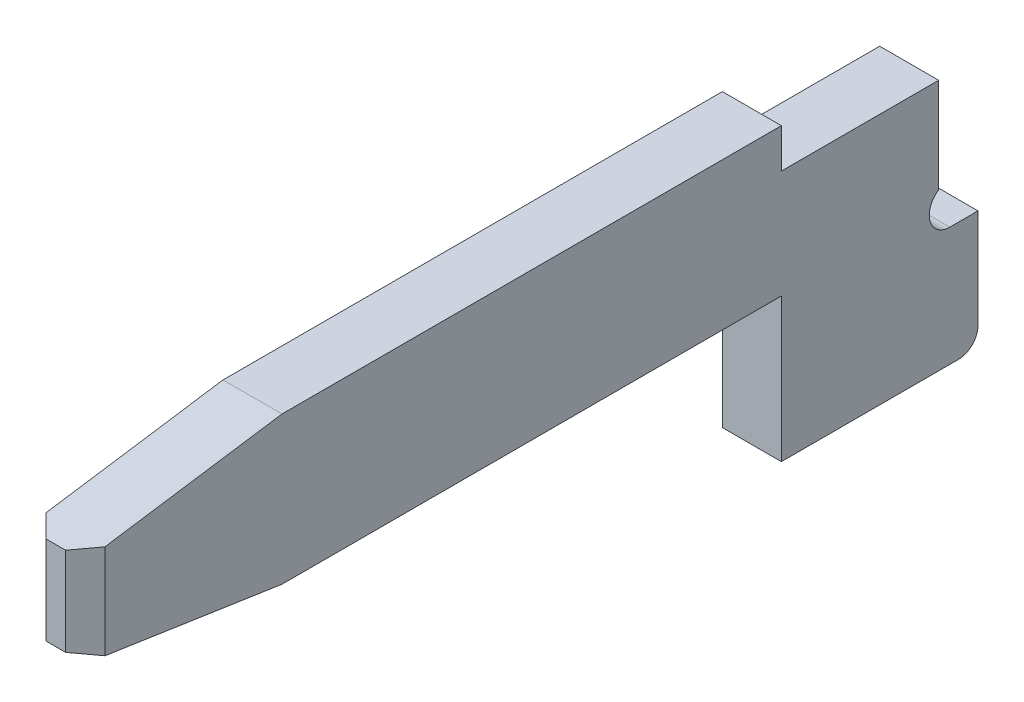
ISO-10303-21;
HEADER;
FILE_DESCRIPTION(('STEP AP214'),'2;1');
FILE_NAME('part.step','',(''),(''),'','','');
FILE_SCHEMA(('AUTOMOTIVE_DESIGN { 1 0 10303 214 1 1 1 1 }'));
ENDSEC;
DATA;
#1=APPLICATION_CONTEXT('core data for automotive mechanical design processes');
#2=APPLICATION_PROTOCOL_DEFINITION('international standard','automotive_design',2000,#1);
#3=PRODUCT_CONTEXT('',#1,'mechanical');
#4=PRODUCT('Part','Part','',(#3));
#5=PRODUCT_RELATED_PRODUCT_CATEGORY('part','',(#4));
#6=PRODUCT_DEFINITION_FORMATION('','',#4);
#7=PRODUCT_DEFINITION_CONTEXT('part definition',#1,'design');
#8=PRODUCT_DEFINITION('design','',#6,#7);
#9=PRODUCT_DEFINITION_SHAPE('','',#8);
#10=(LENGTH_UNIT() NAMED_UNIT(*) SI_UNIT(.MILLI.,.METRE.));
#11=(NAMED_UNIT(*) PLANE_ANGLE_UNIT() SI_UNIT($,.RADIAN.));
#12=(NAMED_UNIT(*) SI_UNIT($,.STERADIAN.) SOLID_ANGLE_UNIT());
#13=UNCERTAINTY_MEASURE_WITH_UNIT(LENGTH_MEASURE(1.E-05),#10,'distance_accuracy_value','');
#14=(GEOMETRIC_REPRESENTATION_CONTEXT(3) GLOBAL_UNCERTAINTY_ASSIGNED_CONTEXT((#13)) GLOBAL_UNIT_ASSIGNED_CONTEXT((#10,
#11,#12)) REPRESENTATION_CONTEXT('',''));
#15=CARTESIAN_POINT('',(0.,0.,0.));
#16=DIRECTION('',(0.,0.,1.));
#17=DIRECTION('',(1.,0.,0.));
#18=AXIS2_PLACEMENT_3D('',#15,#16,#17);
#19=CARTESIAN_POINT('',(-0.05,-0.55,3.94));
#20=DIRECTION('',(0.707106781186548,0.,-0.707106781186548));
#21=DIRECTION('',(-0.707106781186548,0.,-0.707106781186548));
#22=AXIS2_PLACEMENT_3D('',#19,#20,#21);
#23=PLANE('',#22);
#24=DIRECTION('',(0.,1.,0.));
#25=VECTOR('',#24,1.);
#26=CARTESIAN_POINT('',(-0.15,-1.18,3.84));
#27=LINE('',#26,#25);
#28=CARTESIAN_POINT('',(-0.15,0.0649999999999868,3.84));
#29=VERTEX_POINT('',#28);
#30=CARTESIAN_POINT('',(-0.15,-0.415000000000178,3.84000000000002));
#31=VERTEX_POINT('',#30);
#32=EDGE_CURVE('E261',#29,#31,#27,.F.);
#33=ORIENTED_EDGE('',*,*,#32,.T.);
#34=DIRECTION('',(0.703162553934632,0.105474383090055,0.703162553934649));
#35=VECTOR('',#34,1.);
#36=CARTESIAN_POINT('',(-0.15,-0.415000000000178,3.84000000000003));
#37=LINE('',#36,#35);
#38=CARTESIAN_POINT('',(-0.0499999999999999,-0.400000000000148,3.94000000000002));
#39=VERTEX_POINT('',#38);
#40=EDGE_CURVE('E258',#31,#39,#37,.T.);
#41=ORIENTED_EDGE('',*,*,#40,.T.);
#42=DIRECTION('',(0.,1.,0.));
#43=VECTOR('',#42,1.);
#44=CARTESIAN_POINT('',(-0.05,-0.55,3.94));
#45=LINE('',#44,#43);
#46=CARTESIAN_POINT('',(-0.05,0.05,3.94));
#47=VERTEX_POINT('',#46);
#48=EDGE_CURVE('E264',#39,#47,#45,.T.);
#49=ORIENTED_EDGE('',*,*,#48,.T.);
#50=DIRECTION('',(-0.70316255393463,0.105474383090055,-0.703162553934651));
#51=VECTOR('',#50,1.);
#52=CARTESIAN_POINT('',(-0.05,0.05,3.94));
#53=LINE('',#52,#51);
#54=EDGE_CURVE('E219',#47,#29,#53,.T.);
#55=ORIENTED_EDGE('',*,*,#54,.T.);
#56=EDGE_LOOP('',(#33,#41,#49,#55));
#57=FACE_BOUND('',#56,.T.);
#58=ADVANCED_FACE('F17',(#57),#23,.F.);
#59=CARTESIAN_POINT('',(0.15,-0.55,3.94));
#60=DIRECTION('',(0.,0.,-1.));
#61=DIRECTION('',(-1.,0.,0.));
#62=AXIS2_PLACEMENT_3D('',#59,#60,#61);
#63=PLANE('',#62);
#64=ORIENTED_EDGE('',*,*,#48,.F.);
#65=DIRECTION('',(1.,0.,0.));
#66=VECTOR('',#65,1.);
#67=CARTESIAN_POINT('',(0.15,-0.400000000000198,3.94000000000003));
#68=LINE('',#67,#66);
#69=CARTESIAN_POINT('',(0.05,-0.400000000000198,3.94000000000002));
#70=VERTEX_POINT('',#69);
#71=EDGE_CURVE('E253',#39,#70,#68,.T.);
#72=ORIENTED_EDGE('',*,*,#71,.T.);
#73=DIRECTION('',(0.,1.,0.));
#74=VECTOR('',#73,1.);
#75=CARTESIAN_POINT('',(0.0500000000000001,-1.18,3.94));
#76=LINE('',#75,#74);
#77=CARTESIAN_POINT('',(0.0500000000000001,0.0500000000000004,3.94));
#78=VERTEX_POINT('',#77);
#79=EDGE_CURVE('E192',#78,#70,#76,.F.);
#80=ORIENTED_EDGE('',*,*,#79,.F.);
#81=DIRECTION('',(1.,0.,0.));
#82=VECTOR('',#81,1.);
#83=CARTESIAN_POINT('',(0.15,0.05,3.94));
#84=LINE('',#83,#82);
#85=EDGE_CURVE('E263',#78,#47,#84,.F.);
#86=ORIENTED_EDGE('',*,*,#85,.T.);
#87=EDGE_LOOP('',(#64,#72,#80,#86));
#88=FACE_BOUND('',#87,.T.);
#89=ADVANCED_FACE('F377',(#88),#63,.F.);
#90=CARTESIAN_POINT('',(-0.15,-1.18,-0.5));
#91=DIRECTION('',(1.,0.,0.));
#92=DIRECTION('',(0.,0.,-1.));
#93=AXIS2_PLACEMENT_3D('',#90,#91,#92);
#94=PLANE('',#93);
#95=ORIENTED_EDGE('',*,*,#32,.F.);
#96=DIRECTION('',(0.,0.148340452930049,-0.988936352868327));
#97=VECTOR('',#96,1.);
#98=CARTESIAN_POINT('',(-0.15,0.05,3.94));
#99=LINE('',#98,#97);
#100=CARTESIAN_POINT('',(-0.15,0.199999999999934,2.93999999999999));
#101=VERTEX_POINT('',#100);
#102=EDGE_CURVE('E203',#29,#101,#99,.T.);
#103=ORIENTED_EDGE('',*,*,#102,.T.);
#104=DIRECTION('',(0.,0.,-1.));
#105=VECTOR('',#104,1.);
#106=CARTESIAN_POINT('',(-0.15,0.2,3.94));
#107=LINE('',#106,#105);
#108=CARTESIAN_POINT('',(-0.15,0.2,0.4));
#109=VERTEX_POINT('',#108);
#110=EDGE_CURVE('E208',#101,#109,#107,.T.);
#111=ORIENTED_EDGE('',*,*,#110,.T.);
#112=DIRECTION('',(0.,1.,0.));
#113=VECTOR('',#112,1.);
#114=CARTESIAN_POINT('',(-0.15,0.2,0.4));
#115=LINE('',#114,#113);
#116=CARTESIAN_POINT('',(-0.15,0.,0.4));
#117=VERTEX_POINT('',#116);
#118=EDGE_CURVE('E320',#109,#117,#115,.F.);
#119=ORIENTED_EDGE('',*,*,#118,.T.);
#120=DIRECTION('',(0.,0.,-1.));
#121=VECTOR('',#120,1.);
#122=CARTESIAN_POINT('',(-0.15,0.,0.4));
#123=LINE('',#122,#121);
#124=CARTESIAN_POINT('',(-0.15,0.,-0.4));
#125=VERTEX_POINT('',#124);
#126=EDGE_CURVE('E233',#117,#125,#123,.T.);
#127=ORIENTED_EDGE('',*,*,#126,.T.);
#128=DIRECTION('',(0.,1.,0.));
#129=VECTOR('',#128,1.);
#130=CARTESIAN_POINT('',(-0.15,0.,-0.4));
#131=LINE('',#130,#129);
#132=CARTESIAN_POINT('',(-0.15,-0.482595810967629,-0.4));
#133=VERTEX_POINT('',#132);
#134=EDGE_CURVE('E226',#125,#133,#131,.F.);
#135=ORIENTED_EDGE('',*,*,#134,.T.);
#136=CARTESIAN_POINT('',(-0.15,-0.570592732328,-0.45673490971));
#137=DIRECTION('',(-1.,0.,0.));
#138=DIRECTION('',(0.,0.,1.));
#139=AXIS2_PLACEMENT_3D('',#136,#137,#138);
#140=CIRCLE('',#139,0.104701041775);
#141=CARTESIAN_POINT('',(-0.15,-0.675293774103,-0.45673490971));
#142=VERTEX_POINT('',#141);
#143=EDGE_CURVE('E293',#133,#142,#140,.F.);
#144=ORIENTED_EDGE('',*,*,#143,.T.);
#145=DIRECTION('',(0.,0.,-1.));
#146=VECTOR('',#145,1.);
#147=CARTESIAN_POINT('',(-0.15,-0.675293774103,-0.45673490971));
#148=LINE('',#147,#146);
#149=CARTESIAN_POINT('',(-0.15,-0.675293774103,-0.6));
#150=VERTEX_POINT('',#149);
#151=EDGE_CURVE('E143',#142,#150,#148,.T.);
#152=ORIENTED_EDGE('',*,*,#151,.T.);
#153=DIRECTION('',(0.,1.,0.));
#154=VECTOR('',#153,1.);
#155=CARTESIAN_POINT('',(-0.15,-0.675293774103,-0.6));
#156=LINE('',#155,#154);
#157=CARTESIAN_POINT('',(-0.15,-1.18,-0.6));
#158=VERTEX_POINT('',#157);
#159=EDGE_CURVE('E139',#150,#158,#156,.F.);
#160=ORIENTED_EDGE('',*,*,#159,.T.);
#161=CARTESIAN_POINT('',(-0.15,-1.18,-0.5));
#162=DIRECTION('',(-1.,0.,0.));
#163=DIRECTION('',(0.,0.,1.));
#164=AXIS2_PLACEMENT_3D('',#161,#162,#163);
#165=CIRCLE('',#164,0.1);
#166=CARTESIAN_POINT('',(-0.15,-1.28,-0.5));
#167=VERTEX_POINT('',#166);
#168=EDGE_CURVE('E20',#167,#158,#165,.F.);
#169=ORIENTED_EDGE('',*,*,#168,.F.);
#170=DIRECTION('',(0.,0.,1.));
#171=VECTOR('',#170,1.);
#172=CARTESIAN_POINT('',(-0.15,-1.28,-0.6));
#173=LINE('',#172,#171);
#174=CARTESIAN_POINT('',(-0.15,-1.28,0.4));
#175=VERTEX_POINT('',#174);
#176=EDGE_CURVE('E137',#167,#175,#173,.T.);
#177=ORIENTED_EDGE('',*,*,#176,.T.);
#178=DIRECTION('',(0.,1.,0.));
#179=VECTOR('',#178,1.);
#180=CARTESIAN_POINT('',(-0.15,-1.28,0.4));
#181=LINE('',#180,#179);
#182=CARTESIAN_POINT('',(-0.15,-0.55,0.4));
#183=VERTEX_POINT('',#182);
#184=EDGE_CURVE('E160',#175,#183,#181,.T.);
#185=ORIENTED_EDGE('',*,*,#184,.T.);
#186=DIRECTION('',(0.,0.,1.));
#187=VECTOR('',#186,1.);
#188=CARTESIAN_POINT('',(-0.15,-0.55,3.94));
#189=LINE('',#188,#187);
#190=CARTESIAN_POINT('',(-0.15,-0.55,2.94));
#191=VERTEX_POINT('',#190);
#192=EDGE_CURVE('E181',#183,#191,#189,.T.);
#193=ORIENTED_EDGE('',*,*,#192,.T.);
#194=DIRECTION('',(0.,0.148340452930049,0.988936352868327));
#195=VECTOR('',#194,1.);
#196=CARTESIAN_POINT('',(-0.15,-0.55,2.94));
#197=LINE('',#196,#195);
#198=EDGE_CURVE('E191',#191,#31,#197,.T.);
#199=ORIENTED_EDGE('',*,*,#198,.T.);
#200=EDGE_LOOP('',(#95,#103,#111,#119,#127,#135,#144,#152,#160,#169,#177,#185,#193,#199));
#201=FACE_BOUND('',#200,.T.);
#202=ADVANCED_FACE('F141',(#201),#94,.F.);
#203=CARTESIAN_POINT('',(0.15,0.05,3.94));
#204=DIRECTION('',(0.,-0.988936352868327,-0.148340452930049));
#205=DIRECTION('',(0.,0.148340452930049,-0.988936352868327));
#206=AXIS2_PLACEMENT_3D('',#203,#204,#205);
#207=PLANE('',#206);
#208=ORIENTED_EDGE('',*,*,#54,.F.);
#209=ORIENTED_EDGE('',*,*,#85,.F.);
#210=DIRECTION('',(-0.70316255393463,-0.105474383090195,0.70316255393463));
#211=VECTOR('',#210,1.);
#212=CARTESIAN_POINT('',(0.15,0.0650000000000004,3.84));
#213=LINE('',#212,#211);
#214=CARTESIAN_POINT('',(0.15,0.0650000000000001,3.84));
#215=VERTEX_POINT('',#214);
#216=EDGE_CURVE('E200',#215,#78,#213,.T.);
#217=ORIENTED_EDGE('',*,*,#216,.F.);
#218=DIRECTION('',(0.,-0.148340452930245,0.988936352868298));
#219=VECTOR('',#218,1.);
#220=CARTESIAN_POINT('',(0.15,0.2,2.94));
#221=LINE('',#220,#219);
#222=CARTESIAN_POINT('',(0.15,0.2,2.94));
#223=VERTEX_POINT('',#222);
#224=EDGE_CURVE('E197',#223,#215,#221,.T.);
#225=ORIENTED_EDGE('',*,*,#224,.F.);
#226=DIRECTION('',(1.,0.,0.));
#227=VECTOR('',#226,1.);
#228=CARTESIAN_POINT('',(0.15,0.2,2.94));
#229=LINE('',#228,#227);
#230=EDGE_CURVE('E211',#223,#101,#229,.F.);
#231=ORIENTED_EDGE('',*,*,#230,.T.);
#232=ORIENTED_EDGE('',*,*,#102,.F.);
#233=EDGE_LOOP('',(#208,#209,#217,#225,#231,#232));
#234=FACE_BOUND('',#233,.T.);
#235=ADVANCED_FACE('F350',(#234),#207,.F.);
#236=CARTESIAN_POINT('',(0.15,-1.18,3.84));
#237=DIRECTION('',(0.707106781186548,0.,0.707106781186548));
#238=DIRECTION('',(0.707106781186548,0.,-0.707106781186548));
#239=AXIS2_PLACEMENT_3D('',#236,#237,#238);
#240=PLANE('',#239);
#241=DIRECTION('',(0.703162553934632,-0.105474383090055,-0.703162553934649));
#242=VECTOR('',#241,1.);
#243=CARTESIAN_POINT('',(0.05,-0.400000000000198,3.94000000000003));
#244=LINE('',#243,#242);
#245=CARTESIAN_POINT('',(0.15,-0.415000000000059,3.84000000000001));
#246=VERTEX_POINT('',#245);
#247=EDGE_CURVE('E189',#70,#246,#244,.T.);
#248=ORIENTED_EDGE('',*,*,#247,.T.);
#249=DIRECTION('',(0.,1.,0.));
#250=VECTOR('',#249,1.);
#251=CARTESIAN_POINT('',(0.15,-1.18,3.84));
#252=LINE('',#251,#250);
#253=EDGE_CURVE('E186',#215,#246,#252,.F.);
#254=ORIENTED_EDGE('',*,*,#253,.F.);
#255=ORIENTED_EDGE('',*,*,#216,.T.);
#256=ORIENTED_EDGE('',*,*,#79,.T.);
#257=EDGE_LOOP('',(#248,#254,#255,#256));
#258=FACE_BOUND('',#257,.T.);
#259=ADVANCED_FACE('F354',(#258),#240,.T.);
#260=CARTESIAN_POINT('',(0.15,-0.55,2.94));
#261=DIRECTION('',(0.,0.988936352868327,-0.148340452930049));
#262=DIRECTION('',(0.,0.148340452930049,0.988936352868327));
#263=AXIS2_PLACEMENT_3D('',#260,#261,#262);
#264=PLANE('',#263);
#265=ORIENTED_EDGE('',*,*,#40,.F.);
#266=ORIENTED_EDGE('',*,*,#198,.F.);
#267=DIRECTION('',(1.,0.,0.));
#268=VECTOR('',#267,1.);
#269=CARTESIAN_POINT('',(0.15,-0.55,2.94));
#270=LINE('',#269,#268);
#271=CARTESIAN_POINT('',(0.15,-0.55,2.94));
#272=VERTEX_POINT('',#271);
#273=EDGE_CURVE('E172',#191,#272,#270,.T.);
#274=ORIENTED_EDGE('',*,*,#273,.T.);
#275=DIRECTION('',(0.,-0.148340452930245,-0.988936352868298));
#276=VECTOR('',#275,1.);
#277=CARTESIAN_POINT('',(0.15,-0.415,3.84));
#278=LINE('',#277,#276);
#279=EDGE_CURVE('E177',#246,#272,#278,.T.);
#280=ORIENTED_EDGE('',*,*,#279,.F.);
#281=ORIENTED_EDGE('',*,*,#247,.F.);
#282=ORIENTED_EDGE('',*,*,#71,.F.);
#283=EDGE_LOOP('',(#265,#266,#274,#280,#281,#282));
#284=FACE_BOUND('',#283,.T.);
#285=ADVANCED_FACE('F360',(#284),#264,.F.);
#286=CARTESIAN_POINT('',(0.15,-0.55,3.94));
#287=DIRECTION('',(0.,1.,0.));
#288=DIRECTION('',(0.,0.,1.));
#289=AXIS2_PLACEMENT_3D('',#286,#287,#288);
#290=PLANE('',#289);
#291=ORIENTED_EDGE('',*,*,#273,.F.);
#292=ORIENTED_EDGE('',*,*,#192,.F.);
#293=DIRECTION('',(-1.,0.,0.));
#294=VECTOR('',#293,1.);
#295=CARTESIAN_POINT('',(0.15,-0.55,0.4));
#296=LINE('',#295,#294);
#297=CARTESIAN_POINT('',(0.15,-0.55,0.4));
#298=VERTEX_POINT('',#297);
#299=EDGE_CURVE('E170',#183,#298,#296,.F.);
#300=ORIENTED_EDGE('',*,*,#299,.T.);
#301=DIRECTION('',(0.,0.,-1.));
#302=VECTOR('',#301,1.);
#303=CARTESIAN_POINT('',(0.15,-0.55,-0.5));
#304=LINE('',#303,#302);
#305=EDGE_CURVE('E167',#272,#298,#304,.T.);
#306=ORIENTED_EDGE('',*,*,#305,.F.);
#307=EDGE_LOOP('',(#291,#292,#300,#306));
#308=FACE_BOUND('',#307,.T.);
#309=ADVANCED_FACE('F365',(#308),#290,.F.);
#310=CARTESIAN_POINT('',(0.15,-1.28,0.4));
#311=DIRECTION('',(0.,0.,-1.));
#312=DIRECTION('',(-1.,0.,0.));
#313=AXIS2_PLACEMENT_3D('',#310,#311,#312);
#314=PLANE('',#313);
#315=DIRECTION('',(1.,0.,0.));
#316=VECTOR('',#315,1.);
#317=CARTESIAN_POINT('',(0.15,-1.28,0.4));
#318=LINE('',#317,#316);
#319=CARTESIAN_POINT('',(0.15,-1.28,0.4));
#320=VERTEX_POINT('',#319);
#321=EDGE_CURVE('E158',#175,#320,#318,.T.);
#322=ORIENTED_EDGE('',*,*,#321,.T.);
#323=DIRECTION('',(0.,1.,0.));
#324=VECTOR('',#323,1.);
#325=CARTESIAN_POINT('',(0.15,-1.18,0.4));
#326=LINE('',#325,#324);
#327=EDGE_CURVE('E163',#298,#320,#326,.F.);
#328=ORIENTED_EDGE('',*,*,#327,.F.);
#329=ORIENTED_EDGE('',*,*,#299,.F.);
#330=ORIENTED_EDGE('',*,*,#184,.F.);
#331=EDGE_LOOP('',(#322,#328,#329,#330));
#332=FACE_BOUND('',#331,.T.);
#333=ADVANCED_FACE('F370',(#332),#314,.F.);
#334=CARTESIAN_POINT('',(0.15,-1.28,-0.6));
#335=DIRECTION('',(0.,1.,0.));
#336=DIRECTION('',(0.,0.,1.));
#337=AXIS2_PLACEMENT_3D('',#334,#335,#336);
#338=PLANE('',#337);
#339=DIRECTION('',(-1.,0.,0.));
#340=VECTOR('',#339,1.);
#341=CARTESIAN_POINT('',(0.15,-1.28,-0.5));
#342=LINE('',#341,#340);
#343=CARTESIAN_POINT('',(0.15,-1.28,-0.5));
#344=VERTEX_POINT('',#343);
#345=EDGE_CURVE('E136',#344,#167,#342,.T.);
#346=ORIENTED_EDGE('',*,*,#345,.F.);
#347=DIRECTION('',(0.,0.,-1.));
#348=VECTOR('',#347,1.);
#349=CARTESIAN_POINT('',(0.15,-1.28,-0.5));
#350=LINE('',#349,#348);
#351=EDGE_CURVE('E166',#320,#344,#350,.T.);
#352=ORIENTED_EDGE('',*,*,#351,.F.);
#353=ORIENTED_EDGE('',*,*,#321,.F.);
#354=ORIENTED_EDGE('',*,*,#176,.F.);
#355=EDGE_LOOP('',(#346,#352,#353,#354));
#356=FACE_BOUND('',#355,.T.);
#357=ADVANCED_FACE('F373',(#356),#338,.F.);
#358=CARTESIAN_POINT('',(0.15,-1.18,-0.5));
#359=DIRECTION('',(-1.,0.,0.));
#360=DIRECTION('',(0.,0.,1.));
#361=AXIS2_PLACEMENT_3D('',#358,#359,#360);
#362=CYLINDRICAL_SURFACE('',#361,0.1);
#363=CARTESIAN_POINT('',(0.15,-1.18,-0.5));
#364=DIRECTION('',(-1.,0.,0.));
#365=DIRECTION('',(0.,0.,1.));
#366=AXIS2_PLACEMENT_3D('',#363,#364,#365);
#367=CIRCLE('',#366,0.1);
#368=CARTESIAN_POINT('',(0.15,-1.18,-0.6));
#369=VERTEX_POINT('',#368);
#370=EDGE_CURVE('E292',#344,#369,#367,.F.);
#371=ORIENTED_EDGE('',*,*,#370,.F.);
#372=ORIENTED_EDGE('',*,*,#345,.T.);
#373=ORIENTED_EDGE('',*,*,#168,.T.);
#374=DIRECTION('',(1.,0.,0.));
#375=VECTOR('',#374,1.);
#376=CARTESIAN_POINT('',(0.15,-1.18,-0.6));
#377=LINE('',#376,#375);
#378=EDGE_CURVE('E134',#158,#369,#377,.T.);
#379=ORIENTED_EDGE('',*,*,#378,.T.);
#380=EDGE_LOOP('',(#371,#372,#373,#379));
#381=FACE_BOUND('',#380,.T.);
#382=ADVANCED_FACE('F132',(#381),#362,.T.);
#383=CARTESIAN_POINT('',(0.15,-0.675293774103,-0.6));
#384=DIRECTION('',(0.,0.,1.));
#385=DIRECTION('',(1.,0.,0.));
#386=AXIS2_PLACEMENT_3D('',#383,#384,#385);
#387=PLANE('',#386);
#388=DIRECTION('',(1.,0.,0.));
#389=VECTOR('',#388,1.);
#390=CARTESIAN_POINT('',(0.15,-0.675293774103,-0.6));
#391=LINE('',#390,#389);
#392=CARTESIAN_POINT('',(0.15,-0.675293774103,-0.6));
#393=VERTEX_POINT('',#392);
#394=EDGE_CURVE('E146',#150,#393,#391,.T.);
#395=ORIENTED_EDGE('',*,*,#394,.T.);
#396=DIRECTION('',(0.,1.,0.));
#397=VECTOR('',#396,1.);
#398=CARTESIAN_POINT('',(0.15,-1.18,-0.6));
#399=LINE('',#398,#397);
#400=EDGE_CURVE('E150',#369,#393,#399,.T.);
#401=ORIENTED_EDGE('',*,*,#400,.F.);
#402=ORIENTED_EDGE('',*,*,#378,.F.);
#403=ORIENTED_EDGE('',*,*,#159,.F.);
#404=EDGE_LOOP('',(#395,#401,#402,#403));
#405=FACE_BOUND('',#404,.T.);
#406=ADVANCED_FACE('F148',(#405),#387,.F.);
#407=CARTESIAN_POINT('',(0.15,-0.675293774103,-0.45673490971));
#408=DIRECTION('',(0.,-1.,0.));
#409=DIRECTION('',(0.,0.,-1.));
#410=AXIS2_PLACEMENT_3D('',#407,#408,#409);
#411=PLANE('',#410);
#412=DIRECTION('',(-1.,0.,0.));
#413=VECTOR('',#412,1.);
#414=CARTESIAN_POINT('',(0.15,-0.675293774103,-0.45673490971));
#415=LINE('',#414,#413);
#416=CARTESIAN_POINT('',(0.15,-0.675293774103,-0.45673490971));
#417=VERTEX_POINT('',#416);
#418=EDGE_CURVE('E240',#142,#417,#415,.F.);
#419=ORIENTED_EDGE('',*,*,#418,.T.);
#420=DIRECTION('',(0.,0.,-1.));
#421=VECTOR('',#420,1.);
#422=CARTESIAN_POINT('',(0.15,-0.675293774103,-0.5));
#423=LINE('',#422,#421);
#424=EDGE_CURVE('E291',#393,#417,#423,.F.);
#425=ORIENTED_EDGE('',*,*,#424,.F.);
#426=ORIENTED_EDGE('',*,*,#394,.F.);
#427=ORIENTED_EDGE('',*,*,#151,.F.);
#428=EDGE_LOOP('',(#419,#425,#426,#427));
#429=FACE_BOUND('',#428,.T.);
#430=ADVANCED_FACE('F304',(#429),#411,.F.);
#431=CARTESIAN_POINT('',(0.15,-0.570592732328,-0.45673490971));
#432=DIRECTION('',(-1.,0.,0.));
#433=DIRECTION('',(0.,0.,1.));
#434=AXIS2_PLACEMENT_3D('',#431,#432,#433);
#435=CYLINDRICAL_SURFACE('',#434,0.104701041775);
#436=DIRECTION('',(1.,0.,0.));
#437=VECTOR('',#436,1.);
#438=CARTESIAN_POINT('',(0.15,-0.482595810968,-0.4));
#439=LINE('',#438,#437);
#440=CARTESIAN_POINT('',(0.15,-0.482595810967629,-0.4));
#441=VERTEX_POINT('',#440);
#442=EDGE_CURVE('E230',#133,#441,#439,.T.);
#443=ORIENTED_EDGE('',*,*,#442,.T.);
#444=CARTESIAN_POINT('',(0.15,-0.570592732328,-0.45673490971));
#445=DIRECTION('',(-1.,0.,0.));
#446=DIRECTION('',(0.,0.,1.));
#447=AXIS2_PLACEMENT_3D('',#444,#445,#446);
#448=CIRCLE('',#447,0.104701041775);
#449=EDGE_CURVE('E287',#417,#441,#448,.T.);
#450=ORIENTED_EDGE('',*,*,#449,.F.);
#451=ORIENTED_EDGE('',*,*,#418,.F.);
#452=ORIENTED_EDGE('',*,*,#143,.F.);
#453=EDGE_LOOP('',(#443,#450,#451,#452));
#454=FACE_BOUND('',#453,.T.);
#455=ADVANCED_FACE('F398',(#454),#435,.F.);
#456=CARTESIAN_POINT('',(0.15,0.,-0.4));
#457=DIRECTION('',(0.,0.,1.));
#458=DIRECTION('',(1.,0.,0.));
#459=AXIS2_PLACEMENT_3D('',#456,#457,#458);
#460=PLANE('',#459);
#461=DIRECTION('',(1.,0.,0.));
#462=VECTOR('',#461,1.);
#463=CARTESIAN_POINT('',(0.15,0.,-0.4));
#464=LINE('',#463,#462);
#465=CARTESIAN_POINT('',(0.15,0.,-0.4));
#466=VERTEX_POINT('',#465);
#467=EDGE_CURVE('E229',#125,#466,#464,.T.);
#468=ORIENTED_EDGE('',*,*,#467,.T.);
#469=DIRECTION('',(0.,1.,0.));
#470=VECTOR('',#469,1.);
#471=CARTESIAN_POINT('',(0.15,-1.18,-0.4));
#472=LINE('',#471,#470);
#473=EDGE_CURVE('E290',#441,#466,#472,.T.);
#474=ORIENTED_EDGE('',*,*,#473,.F.);
#475=ORIENTED_EDGE('',*,*,#442,.F.);
#476=ORIENTED_EDGE('',*,*,#134,.F.);
#477=EDGE_LOOP('',(#468,#474,#475,#476));
#478=FACE_BOUND('',#477,.T.);
#479=ADVANCED_FACE('F332',(#478),#460,.F.);
#480=CARTESIAN_POINT('',(0.15,0.,0.4));
#481=DIRECTION('',(0.,-1.,0.));
#482=DIRECTION('',(0.,0.,-1.));
#483=AXIS2_PLACEMENT_3D('',#480,#481,#482);
#484=PLANE('',#483);
#485=DIRECTION('',(1.,0.,0.));
#486=VECTOR('',#485,1.);
#487=CARTESIAN_POINT('',(0.15,0.,0.4));
#488=LINE('',#487,#486);
#489=CARTESIAN_POINT('',(0.15,0.,0.4));
#490=VERTEX_POINT('',#489);
#491=EDGE_CURVE('E236',#117,#490,#488,.T.);
#492=ORIENTED_EDGE('',*,*,#491,.T.);
#493=DIRECTION('',(0.,0.,-1.));
#494=VECTOR('',#493,1.);
#495=CARTESIAN_POINT('',(0.15,0.,-0.5));
#496=LINE('',#495,#494);
#497=EDGE_CURVE('E324',#466,#490,#496,.F.);
#498=ORIENTED_EDGE('',*,*,#497,.F.);
#499=ORIENTED_EDGE('',*,*,#467,.F.);
#500=ORIENTED_EDGE('',*,*,#126,.F.);
#501=EDGE_LOOP('',(#492,#498,#499,#500));
#502=FACE_BOUND('',#501,.T.);
#503=ADVANCED_FACE('F336',(#502),#484,.F.);
#504=CARTESIAN_POINT('',(0.15,0.2,0.4));
#505=DIRECTION('',(0.,0.,1.));
#506=DIRECTION('',(1.,0.,0.));
#507=AXIS2_PLACEMENT_3D('',#504,#505,#506);
#508=PLANE('',#507);
#509=DIRECTION('',(1.,0.,0.));
#510=VECTOR('',#509,1.);
#511=CARTESIAN_POINT('',(0.15,0.2,0.4));
#512=LINE('',#511,#510);
#513=CARTESIAN_POINT('',(0.15,0.2,0.4));
#514=VERTEX_POINT('',#513);
#515=EDGE_CURVE('E35',#109,#514,#512,.T.);
#516=ORIENTED_EDGE('',*,*,#515,.T.);
#517=DIRECTION('',(0.,1.,0.));
#518=VECTOR('',#517,1.);
#519=CARTESIAN_POINT('',(0.15,-1.18,0.4));
#520=LINE('',#519,#518);
#521=EDGE_CURVE('E26',#490,#514,#520,.T.);
#522=ORIENTED_EDGE('',*,*,#521,.F.);
#523=ORIENTED_EDGE('',*,*,#491,.F.);
#524=ORIENTED_EDGE('',*,*,#118,.F.);
#525=EDGE_LOOP('',(#516,#522,#523,#524));
#526=FACE_BOUND('',#525,.T.);
#527=ADVANCED_FACE('F342',(#526),#508,.F.);
#528=CARTESIAN_POINT('',(0.15,0.2,3.94));
#529=DIRECTION('',(0.,-1.,0.));
#530=DIRECTION('',(0.,0.,-1.));
#531=AXIS2_PLACEMENT_3D('',#528,#529,#530);
#532=PLANE('',#531);
#533=ORIENTED_EDGE('',*,*,#230,.F.);
#534=DIRECTION('',(0.,0.,-1.));
#535=VECTOR('',#534,1.);
#536=CARTESIAN_POINT('',(0.15,0.2,-0.5));
#537=LINE('',#536,#535);
#538=EDGE_CURVE('E11',#514,#223,#537,.F.);
#539=ORIENTED_EDGE('',*,*,#538,.F.);
#540=ORIENTED_EDGE('',*,*,#515,.F.);
#541=ORIENTED_EDGE('',*,*,#110,.F.);
#542=EDGE_LOOP('',(#533,#539,#540,#541));
#543=FACE_BOUND('',#542,.T.);
#544=ADVANCED_FACE('F347',(#543),#532,.F.);
#545=CARTESIAN_POINT('',(0.15,-1.18,-0.5));
#546=DIRECTION('',(1.,0.,0.));
#547=DIRECTION('',(0.,0.,-1.));
#548=AXIS2_PLACEMENT_3D('',#545,#546,#547);
#549=PLANE('',#548);
#550=ORIENTED_EDGE('',*,*,#521,.T.);
#551=ORIENTED_EDGE('',*,*,#538,.T.);
#552=ORIENTED_EDGE('',*,*,#224,.T.);
#553=ORIENTED_EDGE('',*,*,#253,.T.);
#554=ORIENTED_EDGE('',*,*,#279,.T.);
#555=ORIENTED_EDGE('',*,*,#305,.T.);
#556=ORIENTED_EDGE('',*,*,#327,.T.);
#557=ORIENTED_EDGE('',*,*,#351,.T.);
#558=ORIENTED_EDGE('',*,*,#370,.T.);
#559=ORIENTED_EDGE('',*,*,#400,.T.);
#560=ORIENTED_EDGE('',*,*,#424,.T.);
#561=ORIENTED_EDGE('',*,*,#449,.T.);
#562=ORIENTED_EDGE('',*,*,#473,.T.);
#563=ORIENTED_EDGE('',*,*,#497,.T.);
#564=EDGE_LOOP('',(#550,#551,#552,#553,#554,#555,#556,#557,#558,#559,#560,#561,#562,#563));
#565=FACE_BOUND('',#564,.T.);
#566=ADVANCED_FACE('F308',(#565),#549,.T.);
#567=CLOSED_SHELL('',(#58,#89,#202,#235,#259,#285,#309,#333,#357,#382,#406,#430,#455,#479,#503,
#527,#544,#566));
#568=MANIFOLD_SOLID_BREP('B1',#567);
#569=ADVANCED_BREP_SHAPE_REPRESENTATION('',(#18,#568),#14);
#570=SHAPE_DEFINITION_REPRESENTATION(#9,#569);
ENDSEC;
END-ISO-10303-21;
